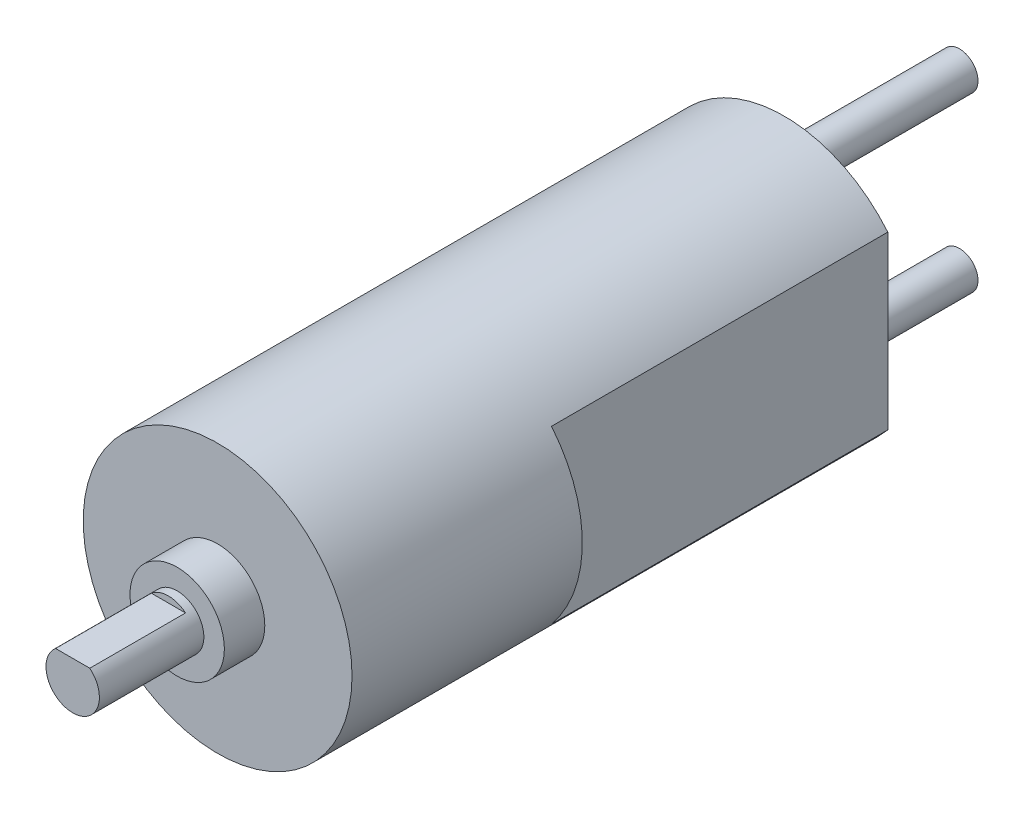
ISO-10303-21;
HEADER;
FILE_DESCRIPTION(('STEP AP214'),'2;1');
FILE_NAME('part.step','',(''),(''),'','','');
FILE_SCHEMA(('AUTOMOTIVE_DESIGN { 1 0 10303 214 1 1 1 1 }'));
ENDSEC;
DATA;
#1=APPLICATION_CONTEXT('core data for automotive mechanical design processes');
#2=APPLICATION_PROTOCOL_DEFINITION('international standard','automotive_design',2000,#1);
#3=PRODUCT_CONTEXT('',#1,'mechanical');
#4=PRODUCT('Part','Part','',(#3));
#5=PRODUCT_RELATED_PRODUCT_CATEGORY('part','',(#4));
#6=PRODUCT_DEFINITION_FORMATION('','',#4);
#7=PRODUCT_DEFINITION_CONTEXT('part definition',#1,'design');
#8=PRODUCT_DEFINITION('design','',#6,#7);
#9=PRODUCT_DEFINITION_SHAPE('','',#8);
#10=(LENGTH_UNIT() NAMED_UNIT(*) SI_UNIT(.MILLI.,.METRE.));
#11=(NAMED_UNIT(*) PLANE_ANGLE_UNIT() SI_UNIT($,.RADIAN.));
#12=(NAMED_UNIT(*) SI_UNIT($,.STERADIAN.) SOLID_ANGLE_UNIT());
#13=UNCERTAINTY_MEASURE_WITH_UNIT(LENGTH_MEASURE(1.E-05),#10,'distance_accuracy_value','');
#14=(GEOMETRIC_REPRESENTATION_CONTEXT(3) GLOBAL_UNCERTAINTY_ASSIGNED_CONTEXT((#13)) GLOBAL_UNIT_ASSIGNED_CONTEXT((#10,
#11,#12)) REPRESENTATION_CONTEXT('',''));
#15=CARTESIAN_POINT('',(0.,0.,0.));
#16=DIRECTION('',(0.,0.,1.));
#17=DIRECTION('',(1.,0.,0.));
#18=AXIS2_PLACEMENT_3D('',#15,#16,#17);
#19=CARTESIAN_POINT('',(0.,0.,-26.6428));
#20=DIRECTION('',(0.,0.,-1.));
#21=DIRECTION('',(-1.,0.,0.));
#22=AXIS2_PLACEMENT_3D('',#19,#20,#21);
#23=TOROIDAL_SURFACE('',#22,2.91,0.1);
#24=CARTESIAN_POINT('',(0.,0.,-26.7428));
#25=DIRECTION('',(0.,0.,-1.));
#26=DIRECTION('',(-1.,0.,0.));
#27=AXIS2_PLACEMENT_3D('',#24,#25,#26);
#28=CIRCLE('',#27,2.91);
#29=CARTESIAN_POINT('',(-2.91,0.,-26.7428));
#30=VERTEX_POINT('',#29);
#31=EDGE_CURVE('E186',#30,#30,#28,.T.);
#32=ORIENTED_EDGE('',*,*,#31,.F.);
#33=EDGE_LOOP('',(#32));
#34=FACE_BOUND('',#33,.T.);
#35=CARTESIAN_POINT('',(0.,0.,-26.6428));
#36=DIRECTION('',(0.,0.,-1.));
#37=DIRECTION('',(-1.,0.,0.));
#38=AXIS2_PLACEMENT_3D('',#35,#36,#37);
#39=CIRCLE('',#38,3.01);
#40=CARTESIAN_POINT('',(-3.01,0.,-26.6428));
#41=VERTEX_POINT('',#40);
#42=EDGE_CURVE('E190',#41,#41,#39,.F.);
#43=ORIENTED_EDGE('',*,*,#42,.F.);
#44=EDGE_LOOP('',(#43));
#45=FACE_BOUND('',#44,.T.);
#46=ADVANCED_FACE('F43',(#34,#45),#23,.T.);
#47=CARTESIAN_POINT('',(0.,0.,-25.4428));
#48=DIRECTION('',(0.,0.,1.));
#49=DIRECTION('',(1.,0.,0.));
#50=AXIS2_PLACEMENT_3D('',#47,#48,#49);
#51=TOROIDAL_SURFACE('',#50,3.51,0.5);
#52=CARTESIAN_POINT('',(0.,0.,-25.4428));
#53=DIRECTION('',(0.,0.,1.));
#54=DIRECTION('',(1.,0.,0.));
#55=AXIS2_PLACEMENT_3D('',#52,#53,#54);
#56=CIRCLE('',#55,3.01);
#57=CARTESIAN_POINT('',(3.01,0.,-25.4428));
#58=VERTEX_POINT('',#57);
#59=EDGE_CURVE('E127',#58,#58,#56,.F.);
#60=ORIENTED_EDGE('',*,*,#59,.F.);
#61=EDGE_LOOP('',(#60));
#62=FACE_BOUND('',#61,.T.);
#63=CARTESIAN_POINT('',(0.,0.,-24.9428));
#64=DIRECTION('',(0.,0.,1.));
#65=DIRECTION('',(1.,0.,0.));
#66=AXIS2_PLACEMENT_3D('',#63,#64,#65);
#67=CIRCLE('',#66,3.51);
#68=CARTESIAN_POINT('',(3.51,0.,-24.9428));
#69=VERTEX_POINT('',#68);
#70=EDGE_CURVE('E182',#69,#69,#67,.T.);
#71=ORIENTED_EDGE('',*,*,#70,.F.);
#72=EDGE_LOOP('',(#71));
#73=FACE_BOUND('',#72,.T.);
#74=ADVANCED_FACE('F228',(#62,#73),#51,.F.);
#75=CARTESIAN_POINT('',(0.,0.,0.));
#76=DIRECTION('',(0.,0.,1.));
#77=DIRECTION('',(1.,0.,0.));
#78=AXIS2_PLACEMENT_3D('',#75,#76,#77);
#79=PLANE('',#78);
#80=DIRECTION('',(0.,1.,0.));
#81=VECTOR('',#80,1.);
#82=CARTESIAN_POINT('',(-7.6835,6.3525394922031,0.));
#83=LINE('',#82,#81);
#84=CARTESIAN_POINT('',(-7.6835,-6.3525394922031,0.));
#85=VERTEX_POINT('',#84);
#86=CARTESIAN_POINT('',(-7.6835,6.3525394922031,0.));
#87=VERTEX_POINT('',#86);
#88=EDGE_CURVE('E65',#85,#87,#83,.T.);
#89=ORIENTED_EDGE('',*,*,#88,.F.);
#90=CARTESIAN_POINT('',(0.,0.,0.));
#91=DIRECTION('',(0.,0.,1.));
#92=DIRECTION('',(1.,0.,0.));
#93=AXIS2_PLACEMENT_3D('',#90,#91,#92);
#94=CIRCLE('',#93,9.9695);
#95=EDGE_CURVE('E175',#87,#85,#94,.T.);
#96=ORIENTED_EDGE('',*,*,#95,.F.);
#97=EDGE_LOOP('',(#89,#96));
#98=FACE_BOUND('',#97,.T.);
#99=ADVANCED_FACE('F233',(#98),#79,.F.);
#100=DIRECTION('',(0.,-1.,0.));
#101=VECTOR('',#100,1.);
#102=CARTESIAN_POINT('',(7.6835,6.3525394922031,0.));
#103=LINE('',#102,#101);
#104=CARTESIAN_POINT('',(7.6835,6.3525394922031,0.));
#105=VERTEX_POINT('',#104);
#106=CARTESIAN_POINT('',(7.6835,-6.3525394922031,0.));
#107=VERTEX_POINT('',#106);
#108=EDGE_CURVE('E132',#105,#107,#103,.T.);
#109=ORIENTED_EDGE('',*,*,#108,.F.);
#110=EDGE_CURVE('E171',#107,#105,#94,.T.);
#111=ORIENTED_EDGE('',*,*,#110,.F.);
#112=EDGE_LOOP('',(#109,#111));
#113=FACE_BOUND('',#112,.T.);
#114=ADVANCED_FACE('F281',(#113),#79,.F.);
#115=CARTESIAN_POINT('',(0.,0.,17.0815));
#116=DIRECTION('',(0.,0.,-1.));
#117=DIRECTION('',(-1.,0.,0.));
#118=AXIS2_PLACEMENT_3D('',#115,#116,#117);
#119=CYLINDRICAL_SURFACE('',#118,9.9695);
#120=CARTESIAN_POINT('',(0.,0.,17.0815));
#121=DIRECTION('',(0.,0.,1.));
#122=DIRECTION('',(1.,0.,0.));
#123=AXIS2_PLACEMENT_3D('',#120,#121,#122);
#124=CIRCLE('',#123,9.9695);
#125=CARTESIAN_POINT('',(9.9695,0.,17.0815));
#126=VERTEX_POINT('',#125);
#127=EDGE_CURVE('E136',#126,#126,#124,.T.);
#128=ORIENTED_EDGE('',*,*,#127,.F.);
#129=EDGE_LOOP('',(#128));
#130=FACE_BOUND('',#129,.T.);
#131=ORIENTED_EDGE('',*,*,#110,.T.);
#132=DIRECTION('',(0.,0.,1.));
#133=VECTOR('',#132,1.);
#134=CARTESIAN_POINT('',(7.6835,6.3525394922031,-24.9428));
#135=LINE('',#134,#133);
#136=CARTESIAN_POINT('',(7.6835,6.3525394922031,-24.9428));
#137=VERTEX_POINT('',#136);
#138=EDGE_CURVE('E167',#137,#105,#135,.T.);
#139=ORIENTED_EDGE('',*,*,#138,.F.);
#140=CARTESIAN_POINT('',(0.,0.,-24.9428));
#141=DIRECTION('',(0.,0.,-1.));
#142=DIRECTION('',(1.,0.,0.));
#143=AXIS2_PLACEMENT_3D('',#140,#141,#142);
#144=CIRCLE('',#143,9.9695);
#145=CARTESIAN_POINT('',(-7.6835,6.3525394922031,-24.9428));
#146=VERTEX_POINT('',#145);
#147=EDGE_CURVE('E137',#146,#137,#144,.T.);
#148=ORIENTED_EDGE('',*,*,#147,.F.);
#149=DIRECTION('',(0.,0.,1.));
#150=VECTOR('',#149,1.);
#151=CARTESIAN_POINT('',(-7.6835,6.3525394922031,-24.9428));
#152=LINE('',#151,#150);
#153=EDGE_CURVE('E150',#146,#87,#152,.T.);
#154=ORIENTED_EDGE('',*,*,#153,.T.);
#155=ORIENTED_EDGE('',*,*,#95,.T.);
#156=DIRECTION('',(0.,0.,1.));
#157=VECTOR('',#156,1.);
#158=CARTESIAN_POINT('',(-7.6835,-6.3525394922031,-24.9428));
#159=LINE('',#158,#157);
#160=CARTESIAN_POINT('',(-7.6835,-6.3525394922031,-24.9428));
#161=VERTEX_POINT('',#160);
#162=EDGE_CURVE('E159',#161,#85,#159,.T.);
#163=ORIENTED_EDGE('',*,*,#162,.F.);
#164=CARTESIAN_POINT('',(0.,0.,-24.9428));
#165=DIRECTION('',(0.,0.,-1.));
#166=DIRECTION('',(-1.,0.,0.));
#167=AXIS2_PLACEMENT_3D('',#164,#165,#166);
#168=CIRCLE('',#167,9.96950000000001);
#169=CARTESIAN_POINT('',(7.6835,-6.3525394922031,-24.9428));
#170=VERTEX_POINT('',#169);
#171=EDGE_CURVE('E144',#170,#161,#168,.T.);
#172=ORIENTED_EDGE('',*,*,#171,.F.);
#173=DIRECTION('',(0.,0.,1.));
#174=VECTOR('',#173,1.);
#175=CARTESIAN_POINT('',(7.6835,-6.3525394922031,-24.9428));
#176=LINE('',#175,#174);
#177=EDGE_CURVE('E163',#170,#107,#176,.T.);
#178=ORIENTED_EDGE('',*,*,#177,.T.);
#179=EDGE_LOOP('',(#131,#139,#148,#154,#155,#163,#172,#178));
#180=FACE_BOUND('',#179,.T.);
#181=ADVANCED_FACE('F214',(#130,#180),#119,.T.);
#182=CARTESIAN_POINT('',(0.,0.,17.0815));
#183=DIRECTION('',(0.,0.,1.));
#184=DIRECTION('',(1.,0.,0.));
#185=AXIS2_PLACEMENT_3D('',#182,#183,#184);
#186=PLANE('',#185);
#187=CARTESIAN_POINT('',(0.,0.,17.0815));
#188=DIRECTION('',(0.,0.,1.));
#189=DIRECTION('',(1.,0.,0.));
#190=AXIS2_PLACEMENT_3D('',#187,#188,#189);
#191=CIRCLE('',#190,3.5);
#192=CARTESIAN_POINT('',(3.5,0.,17.0815));
#193=VERTEX_POINT('',#192);
#194=EDGE_CURVE('E128',#193,#193,#191,.T.);
#195=ORIENTED_EDGE('',*,*,#194,.F.);
#196=EDGE_LOOP('',(#195));
#197=FACE_BOUND('',#196,.T.);
#198=ORIENTED_EDGE('',*,*,#127,.T.);
#199=EDGE_LOOP('',(#198));
#200=FACE_BOUND('',#199,.T.);
#201=ADVANCED_FACE('F225',(#197,#200),#186,.T.);
#202=CARTESIAN_POINT('',(7.6835,6.3525394922031,-24.9428));
#203=DIRECTION('',(-1.,0.,0.));
#204=DIRECTION('',(0.,0.,1.));
#205=AXIS2_PLACEMENT_3D('',#202,#203,#204);
#206=PLANE('',#205);
#207=ORIENTED_EDGE('',*,*,#108,.T.);
#208=ORIENTED_EDGE('',*,*,#177,.F.);
#209=DIRECTION('',(0.,-1.,0.));
#210=VECTOR('',#209,1.);
#211=CARTESIAN_POINT('',(7.6835,6.3525394922031,-24.9428));
#212=LINE('',#211,#210);
#213=EDGE_CURVE('E141',#137,#170,#212,.T.);
#214=ORIENTED_EDGE('',*,*,#213,.F.);
#215=ORIENTED_EDGE('',*,*,#138,.T.);
#216=EDGE_LOOP('',(#207,#208,#214,#215));
#217=FACE_BOUND('',#216,.T.);
#218=ADVANCED_FACE('F216',(#217),#206,.F.);
#219=CARTESIAN_POINT('',(-7.6835,6.3525394922031,-24.9428));
#220=DIRECTION('',(1.,0.,0.));
#221=DIRECTION('',(0.,0.,-1.));
#222=AXIS2_PLACEMENT_3D('',#219,#220,#221);
#223=PLANE('',#222);
#224=ORIENTED_EDGE('',*,*,#88,.T.);
#225=ORIENTED_EDGE('',*,*,#153,.F.);
#226=DIRECTION('',(0.,1.,0.));
#227=VECTOR('',#226,1.);
#228=CARTESIAN_POINT('',(-7.6835,6.3525394922031,-24.9428));
#229=LINE('',#228,#227);
#230=EDGE_CURVE('E147',#161,#146,#229,.T.);
#231=ORIENTED_EDGE('',*,*,#230,.F.);
#232=ORIENTED_EDGE('',*,*,#162,.T.);
#233=EDGE_LOOP('',(#224,#225,#231,#232));
#234=FACE_BOUND('',#233,.T.);
#235=ADVANCED_FACE('F203',(#234),#223,.F.);
#236=CARTESIAN_POINT('',(0.,0.,-24.9428));
#237=DIRECTION('',(0.,0.,1.));
#238=DIRECTION('',(1.,0.,0.));
#239=AXIS2_PLACEMENT_3D('',#236,#237,#238);
#240=PLANE('',#239);
#241=CARTESIAN_POINT('',(0.,-6.41,-24.9428));
#242=DIRECTION('',(0.,0.,1.));
#243=DIRECTION('',(1.,0.,0.));
#244=AXIS2_PLACEMENT_3D('',#241,#242,#243);
#245=CIRCLE('',#244,1.375);
#246=CARTESIAN_POINT('',(1.375,-6.41,-24.9428));
#247=VERTEX_POINT('',#246);
#248=EDGE_CURVE('E11',#247,#247,#245,.F.);
#249=ORIENTED_EDGE('',*,*,#248,.F.);
#250=EDGE_LOOP('',(#249));
#251=FACE_BOUND('',#250,.T.);
#252=CARTESIAN_POINT('',(0.,6.41,-24.9428));
#253=DIRECTION('',(0.,0.,1.));
#254=DIRECTION('',(1.,0.,0.));
#255=AXIS2_PLACEMENT_3D('',#252,#253,#254);
#256=CIRCLE('',#255,1.375);
#257=CARTESIAN_POINT('',(1.375,6.41,-24.9428));
#258=VERTEX_POINT('',#257);
#259=EDGE_CURVE('E51',#258,#258,#256,.F.);
#260=ORIENTED_EDGE('',*,*,#259,.F.);
#261=EDGE_LOOP('',(#260));
#262=FACE_BOUND('',#261,.T.);
#263=ORIENTED_EDGE('',*,*,#70,.T.);
#264=EDGE_LOOP('',(#263));
#265=FACE_BOUND('',#264,.T.);
#266=ORIENTED_EDGE('',*,*,#147,.T.);
#267=ORIENTED_EDGE('',*,*,#213,.T.);
#268=ORIENTED_EDGE('',*,*,#171,.T.);
#269=ORIENTED_EDGE('',*,*,#230,.T.);
#270=EDGE_LOOP('',(#266,#267,#268,#269));
#271=FACE_BOUND('',#270,.T.);
#272=ADVANCED_FACE('F199',(#251,#262,#265,#271),#240,.F.);
#273=CARTESIAN_POINT('',(0.,0.,20.0815));
#274=DIRECTION('',(0.,0.,-1.));
#275=DIRECTION('',(-1.,0.,0.));
#276=AXIS2_PLACEMENT_3D('',#273,#274,#275);
#277=CYLINDRICAL_SURFACE('',#276,3.5);
#278=CARTESIAN_POINT('',(0.,0.,20.0815));
#279=DIRECTION('',(0.,0.,1.));
#280=DIRECTION('',(1.,0.,0.));
#281=AXIS2_PLACEMENT_3D('',#278,#279,#280);
#282=CIRCLE('',#281,3.5);
#283=CARTESIAN_POINT('',(3.5,0.,20.0815));
#284=VERTEX_POINT('',#283);
#285=EDGE_CURVE('E122',#284,#284,#282,.T.);
#286=ORIENTED_EDGE('',*,*,#285,.F.);
#287=EDGE_LOOP('',(#286));
#288=FACE_BOUND('',#287,.T.);
#289=ORIENTED_EDGE('',*,*,#194,.T.);
#290=EDGE_LOOP('',(#289));
#291=FACE_BOUND('',#290,.T.);
#292=ADVANCED_FACE('F202',(#288,#291),#277,.T.);
#293=CARTESIAN_POINT('',(0.,0.,20.0815));
#294=DIRECTION('',(0.,0.,1.));
#295=DIRECTION('',(1.,0.,0.));
#296=AXIS2_PLACEMENT_3D('',#293,#294,#295);
#297=PLANE('',#296);
#298=CARTESIAN_POINT('',(0.,0.,20.0815));
#299=DIRECTION('',(0.,0.,1.));
#300=DIRECTION('',(1.,0.,0.));
#301=AXIS2_PLACEMENT_3D('',#298,#299,#300);
#302=CIRCLE('',#301,1.98);
#303=CARTESIAN_POINT('',(1.98,0.,20.0815));
#304=VERTEX_POINT('',#303);
#305=EDGE_CURVE('E123',#304,#304,#302,.T.);
#306=ORIENTED_EDGE('',*,*,#305,.F.);
#307=EDGE_LOOP('',(#306));
#308=FACE_BOUND('',#307,.T.);
#309=ORIENTED_EDGE('',*,*,#285,.T.);
#310=EDGE_LOOP('',(#309));
#311=FACE_BOUND('',#310,.T.);
#312=ADVANCED_FACE('F263',(#308,#311),#297,.T.);
#313=CARTESIAN_POINT('',(0.,0.,27.8315));
#314=DIRECTION('',(0.,0.,-1.));
#315=DIRECTION('',(-1.,0.,0.));
#316=AXIS2_PLACEMENT_3D('',#313,#314,#315);
#317=CYLINDRICAL_SURFACE('',#316,1.98);
#318=CARTESIAN_POINT('',(0.,0.,27.8315));
#319=DIRECTION('',(0.,0.,1.));
#320=DIRECTION('',(1.,0.,0.));
#321=AXIS2_PLACEMENT_3D('',#318,#319,#320);
#322=CIRCLE('',#321,1.98);
#323=CARTESIAN_POINT('',(-1.26885775404495,1.52,27.8315));
#324=VERTEX_POINT('',#323);
#325=CARTESIAN_POINT('',(1.26885775404495,1.52,27.8315));
#326=VERTEX_POINT('',#325);
#327=EDGE_CURVE('E113',#324,#326,#322,.T.);
#328=ORIENTED_EDGE('',*,*,#327,.F.);
#329=DIRECTION('',(0.,0.,1.));
#330=VECTOR('',#329,1.);
#331=CARTESIAN_POINT('',(-1.26885775404495,1.52,20.7315));
#332=LINE('',#331,#330);
#333=CARTESIAN_POINT('',(-1.26885775404495,1.52,20.7315));
#334=VERTEX_POINT('',#333);
#335=EDGE_CURVE('E58',#334,#324,#332,.T.);
#336=ORIENTED_EDGE('',*,*,#335,.F.);
#337=CARTESIAN_POINT('',(0.,0.,20.7315));
#338=DIRECTION('',(0.,0.,1.));
#339=DIRECTION('',(-1.,0.,0.));
#340=AXIS2_PLACEMENT_3D('',#337,#338,#339);
#341=CIRCLE('',#340,1.98);
#342=CARTESIAN_POINT('',(1.26885775404495,1.52,20.7315));
#343=VERTEX_POINT('',#342);
#344=EDGE_CURVE('E97',#343,#334,#341,.T.);
#345=ORIENTED_EDGE('',*,*,#344,.F.);
#346=DIRECTION('',(0.,0.,1.));
#347=VECTOR('',#346,1.);
#348=CARTESIAN_POINT('',(1.26885775404495,1.52,20.7315));
#349=LINE('',#348,#347);
#350=EDGE_CURVE('E106',#343,#326,#349,.T.);
#351=ORIENTED_EDGE('',*,*,#350,.T.);
#352=EDGE_LOOP('',(#328,#336,#345,#351));
#353=FACE_BOUND('',#352,.T.);
#354=ORIENTED_EDGE('',*,*,#305,.T.);
#355=EDGE_LOOP('',(#354));
#356=FACE_BOUND('',#355,.T.);
#357=ADVANCED_FACE('F110',(#353,#356),#317,.T.);
#358=CARTESIAN_POINT('',(0.,0.,27.8315));
#359=DIRECTION('',(0.,0.,1.));
#360=DIRECTION('',(1.,0.,0.));
#361=AXIS2_PLACEMENT_3D('',#358,#359,#360);
#362=PLANE('',#361);
#363=DIRECTION('',(1.,0.,0.));
#364=VECTOR('',#363,1.);
#365=CARTESIAN_POINT('',(-1.26885775404495,1.52,27.8315));
#366=LINE('',#365,#364);
#367=EDGE_CURVE('E103',#324,#326,#366,.T.);
#368=ORIENTED_EDGE('',*,*,#367,.F.);
#369=ORIENTED_EDGE('',*,*,#327,.T.);
#370=EDGE_LOOP('',(#368,#369));
#371=FACE_BOUND('',#370,.T.);
#372=ADVANCED_FACE('F257',(#371),#362,.T.);
#373=CARTESIAN_POINT('',(-1.26885775404495,1.52,20.7315));
#374=DIRECTION('',(0.,-1.,0.));
#375=DIRECTION('',(0.,0.,-1.));
#376=AXIS2_PLACEMENT_3D('',#373,#374,#375);
#377=PLANE('',#376);
#378=ORIENTED_EDGE('',*,*,#367,.T.);
#379=ORIENTED_EDGE('',*,*,#350,.F.);
#380=DIRECTION('',(1.,0.,0.));
#381=VECTOR('',#380,1.);
#382=CARTESIAN_POINT('',(-1.26885775404495,1.52,20.7315));
#383=LINE('',#382,#381);
#384=EDGE_CURVE('E99',#334,#343,#383,.T.);
#385=ORIENTED_EDGE('',*,*,#384,.F.);
#386=ORIENTED_EDGE('',*,*,#335,.T.);
#387=EDGE_LOOP('',(#378,#379,#385,#386));
#388=FACE_BOUND('',#387,.T.);
#389=ADVANCED_FACE('F105',(#388),#377,.F.);
#390=CARTESIAN_POINT('',(0.,0.,20.7315));
#391=DIRECTION('',(0.,0.,-1.));
#392=DIRECTION('',(-1.,0.,0.));
#393=AXIS2_PLACEMENT_3D('',#390,#391,#392);
#394=PLANE('',#393);
#395=ORIENTED_EDGE('',*,*,#344,.T.);
#396=ORIENTED_EDGE('',*,*,#384,.T.);
#397=EDGE_LOOP('',(#395,#396));
#398=FACE_BOUND('',#397,.T.);
#399=ADVANCED_FACE('F98',(#398),#394,.F.);
#400=CARTESIAN_POINT('',(0.,0.,-26.7428));
#401=DIRECTION('',(0.,0.,1.));
#402=DIRECTION('',(1.,0.,0.));
#403=AXIS2_PLACEMENT_3D('',#400,#401,#402);
#404=CYLINDRICAL_SURFACE('',#403,3.01);
#405=ORIENTED_EDGE('',*,*,#42,.T.);
#406=EDGE_LOOP('',(#405));
#407=FACE_BOUND('',#406,.T.);
#408=ORIENTED_EDGE('',*,*,#59,.T.);
#409=EDGE_LOOP('',(#408));
#410=FACE_BOUND('',#409,.T.);
#411=ADVANCED_FACE('F239',(#407,#410),#404,.T.);
#412=CARTESIAN_POINT('',(0.,0.,-26.7428));
#413=DIRECTION('',(0.,0.,-1.));
#414=DIRECTION('',(-1.,0.,0.));
#415=AXIS2_PLACEMENT_3D('',#412,#413,#414);
#416=PLANE('',#415);
#417=ORIENTED_EDGE('',*,*,#31,.T.);
#418=EDGE_LOOP('',(#417));
#419=FACE_BOUND('',#418,.T.);
#420=ADVANCED_FACE('F242',(#419),#416,.T.);
#421=CARTESIAN_POINT('',(0.,6.41,-37.9428));
#422=DIRECTION('',(0.,0.,1.));
#423=DIRECTION('',(1.,0.,0.));
#424=AXIS2_PLACEMENT_3D('',#421,#422,#423);
#425=CYLINDRICAL_SURFACE('',#424,1.375);
#426=CARTESIAN_POINT('',(0.,6.41,-37.9428));
#427=DIRECTION('',(0.,0.,-1.));
#428=DIRECTION('',(-1.,0.,0.));
#429=AXIS2_PLACEMENT_3D('',#426,#427,#428);
#430=CIRCLE('',#429,1.375);
#431=CARTESIAN_POINT('',(-1.375,6.41,-37.9428));
#432=VERTEX_POINT('',#431);
#433=EDGE_CURVE('E471',#432,#432,#430,.T.);
#434=ORIENTED_EDGE('',*,*,#433,.F.);
#435=EDGE_LOOP('',(#434));
#436=FACE_BOUND('',#435,.T.);
#437=ORIENTED_EDGE('',*,*,#259,.T.);
#438=EDGE_LOOP('',(#437));
#439=FACE_BOUND('',#438,.T.);
#440=ADVANCED_FACE('F197',(#436,#439),#425,.T.);
#441=CARTESIAN_POINT('',(0.,6.41,-37.9428));
#442=DIRECTION('',(0.,0.,-1.));
#443=DIRECTION('',(-1.,0.,0.));
#444=AXIS2_PLACEMENT_3D('',#441,#442,#443);
#445=PLANE('',#444);
#446=ORIENTED_EDGE('',*,*,#433,.T.);
#447=EDGE_LOOP('',(#446));
#448=FACE_BOUND('',#447,.T.);
#449=ADVANCED_FACE('F400',(#448),#445,.T.);
#450=CARTESIAN_POINT('',(0.,-6.41,-37.9428));
#451=DIRECTION('',(0.,0.,1.));
#452=DIRECTION('',(1.,0.,0.));
#453=AXIS2_PLACEMENT_3D('',#450,#451,#452);
#454=CYLINDRICAL_SURFACE('',#453,1.375);
#455=CARTESIAN_POINT('',(0.,-6.41,-37.9428));
#456=DIRECTION('',(0.,0.,-1.));
#457=DIRECTION('',(-1.,0.,0.));
#458=AXIS2_PLACEMENT_3D('',#455,#456,#457);
#459=CIRCLE('',#458,1.375);
#460=CARTESIAN_POINT('',(-1.375,-6.41,-37.9428));
#461=VERTEX_POINT('',#460);
#462=EDGE_CURVE('E469',#461,#461,#459,.T.);
#463=ORIENTED_EDGE('',*,*,#462,.F.);
#464=EDGE_LOOP('',(#463));
#465=FACE_BOUND('',#464,.T.);
#466=ORIENTED_EDGE('',*,*,#248,.T.);
#467=EDGE_LOOP('',(#466));
#468=FACE_BOUND('',#467,.T.);
#469=ADVANCED_FACE('F410',(#465,#468),#454,.T.);
#470=CARTESIAN_POINT('',(0.,-6.41,-37.9428));
#471=DIRECTION('',(0.,0.,-1.));
#472=DIRECTION('',(-1.,0.,0.));
#473=AXIS2_PLACEMENT_3D('',#470,#471,#472);
#474=PLANE('',#473);
#475=ORIENTED_EDGE('',*,*,#462,.T.);
#476=EDGE_LOOP('',(#475));
#477=FACE_BOUND('',#476,.T.);
#478=ADVANCED_FACE('F421',(#477),#474,.T.);
#479=CLOSED_SHELL('',(#46,#74,#99,#114,#181,#201,#218,#235,#272,#292,#312,#357,#372,#389,#399,
#411,#420,#440,#449,#469,#478));
#480=MANIFOLD_SOLID_BREP('B2',#479);
#481=ADVANCED_BREP_SHAPE_REPRESENTATION('',(#18,#480),#14);
#482=SHAPE_DEFINITION_REPRESENTATION(#9,#481);
ENDSEC;
END-ISO-10303-21;
